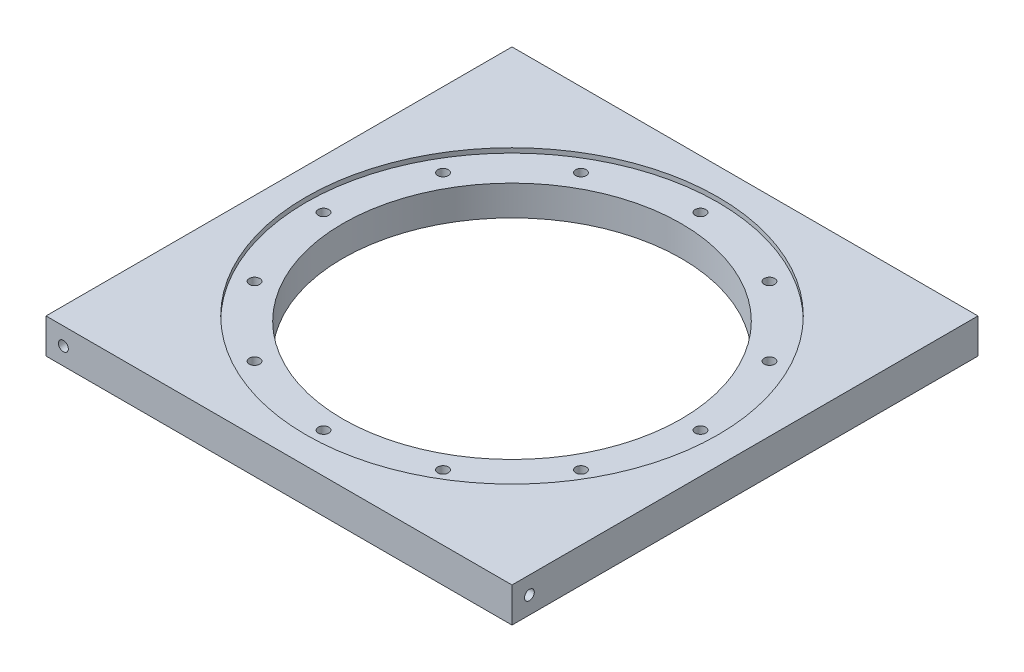
ISO-10303-21;
HEADER;
FILE_DESCRIPTION(('STEP AP214'),'2;1');
FILE_NAME('part.step','',(''),(''),'','','');
FILE_SCHEMA(('AUTOMOTIVE_DESIGN { 1 0 10303 214 1 1 1 1 }'));
ENDSEC;
DATA;
#1=APPLICATION_CONTEXT('core data for automotive mechanical design processes');
#2=APPLICATION_PROTOCOL_DEFINITION('international standard','automotive_design',2000,#1);
#3=PRODUCT_CONTEXT('',#1,'mechanical');
#4=PRODUCT('Part','Part','',(#3));
#5=PRODUCT_RELATED_PRODUCT_CATEGORY('part','',(#4));
#6=PRODUCT_DEFINITION_FORMATION('','',#4);
#7=PRODUCT_DEFINITION_CONTEXT('part definition',#1,'design');
#8=PRODUCT_DEFINITION('design','',#6,#7);
#9=PRODUCT_DEFINITION_SHAPE('','',#8);
#10=(LENGTH_UNIT() NAMED_UNIT(*) SI_UNIT(.MILLI.,.METRE.));
#11=(NAMED_UNIT(*) PLANE_ANGLE_UNIT() SI_UNIT($,.RADIAN.));
#12=(NAMED_UNIT(*) SI_UNIT($,.STERADIAN.) SOLID_ANGLE_UNIT());
#13=UNCERTAINTY_MEASURE_WITH_UNIT(LENGTH_MEASURE(1.E-05),#10,'distance_accuracy_value','');
#14=(GEOMETRIC_REPRESENTATION_CONTEXT(3) GLOBAL_UNCERTAINTY_ASSIGNED_CONTEXT((#13)) GLOBAL_UNIT_ASSIGNED_CONTEXT((#10,
#11,#12)) REPRESENTATION_CONTEXT('',''));
#15=CARTESIAN_POINT('',(0.,0.,0.));
#16=DIRECTION('',(0.,0.,1.));
#17=DIRECTION('',(1.,0.,0.));
#18=AXIS2_PLACEMENT_3D('',#15,#16,#17);
#19=CARTESIAN_POINT('',(63.8175,0.,-63.8175));
#20=DIRECTION('',(0.,1.,0.));
#21=DIRECTION('',(0.,0.,1.));
#22=AXIS2_PLACEMENT_3D('',#19,#20,#21);
#23=CYLINDRICAL_SURFACE('',#22,46.355);
#24=CARTESIAN_POINT('',(63.8175,0.,-63.8175));
#25=DIRECTION('',(0.,1.,0.));
#26=DIRECTION('',(0.,0.,1.));
#27=AXIS2_PLACEMENT_3D('',#24,#25,#26);
#28=CIRCLE('',#27,46.355);
#29=CARTESIAN_POINT('',(63.8175,0.,-17.4625));
#30=VERTEX_POINT('',#29);
#31=EDGE_CURVE('E195',#30,#30,#28,.T.);
#32=ORIENTED_EDGE('',*,*,#31,.F.);
#33=EDGE_LOOP('',(#32));
#34=FACE_BOUND('',#33,.T.);
#35=CARTESIAN_POINT('',(63.8175,8.255,-63.8175));
#36=DIRECTION('',(0.,1.,0.));
#37=DIRECTION('',(0.,0.,1.));
#38=AXIS2_PLACEMENT_3D('',#35,#36,#37);
#39=CIRCLE('',#38,46.355);
#40=CARTESIAN_POINT('',(63.8175,8.255,-17.4625));
#41=VERTEX_POINT('',#40);
#42=EDGE_CURVE('E233',#41,#41,#39,.F.);
#43=ORIENTED_EDGE('',*,*,#42,.F.);
#44=EDGE_LOOP('',(#43));
#45=FACE_BOUND('',#44,.T.);
#46=ADVANCED_FACE('F35',(#34,#45),#23,.F.);
#47=CARTESIAN_POINT('',(63.8175,0.,-115.443));
#48=DIRECTION('',(0.,1.,0.));
#49=DIRECTION('',(0.,0.,1.));
#50=AXIS2_PLACEMENT_3D('',#47,#48,#49);
#51=CYLINDRICAL_SURFACE('',#50,1.4351);
#52=CARTESIAN_POINT('',(63.8175,0.,-115.443));
#53=DIRECTION('',(0.,1.,0.));
#54=DIRECTION('',(0.,0.,1.));
#55=AXIS2_PLACEMENT_3D('',#52,#53,#54);
#56=CIRCLE('',#55,1.4351);
#57=CARTESIAN_POINT('',(63.8175,0.,-114.0079));
#58=VERTEX_POINT('',#57);
#59=EDGE_CURVE('E200',#58,#58,#56,.T.);
#60=ORIENTED_EDGE('',*,*,#59,.F.);
#61=EDGE_LOOP('',(#60));
#62=FACE_BOUND('',#61,.T.);
#63=CARTESIAN_POINT('',(63.8175,8.255,-115.443));
#64=DIRECTION('',(0.,1.,0.));
#65=DIRECTION('',(0.,0.,1.));
#66=AXIS2_PLACEMENT_3D('',#63,#64,#65);
#67=CIRCLE('',#66,1.4351);
#68=CARTESIAN_POINT('',(63.8175,8.255,-114.0079));
#69=VERTEX_POINT('',#68);
#70=EDGE_CURVE('E238',#69,#69,#67,.F.);
#71=ORIENTED_EDGE('',*,*,#70,.F.);
#72=EDGE_LOOP('',(#71));
#73=FACE_BOUND('',#72,.T.);
#74=ADVANCED_FACE('F131',(#62,#73),#51,.F.);
#75=CARTESIAN_POINT('',(38.0047499999999,0.,-108.526494483073));
#76=DIRECTION('',(0.,1.,0.));
#77=DIRECTION('',(0.,0.,1.));
#78=AXIS2_PLACEMENT_3D('',#75,#76,#77);
#79=CYLINDRICAL_SURFACE('',#78,1.4351);
#80=CARTESIAN_POINT('',(38.0047499999999,0.,-108.526494483073));
#81=DIRECTION('',(0.,1.,0.));
#82=DIRECTION('',(0.500000000000001,0.,0.866025403784438));
#83=AXIS2_PLACEMENT_3D('',#80,#81,#82);
#84=CIRCLE('',#83,1.4351);
#85=CARTESIAN_POINT('',(38.7222999999999,0.,-107.283661426102));
#86=VERTEX_POINT('',#85);
#87=EDGE_CURVE('E203',#86,#86,#84,.T.);
#88=ORIENTED_EDGE('',*,*,#87,.F.);
#89=EDGE_LOOP('',(#88));
#90=FACE_BOUND('',#89,.T.);
#91=CARTESIAN_POINT('',(38.0047499999999,8.255,-108.526494483073));
#92=DIRECTION('',(0.,1.,0.));
#93=DIRECTION('',(0.,0.,1.));
#94=AXIS2_PLACEMENT_3D('',#91,#92,#93);
#95=CIRCLE('',#94,1.4351);
#96=CARTESIAN_POINT('',(38.0047499999999,8.255,-107.091394483074));
#97=VERTEX_POINT('',#96);
#98=EDGE_CURVE('E241',#97,#97,#95,.F.);
#99=ORIENTED_EDGE('',*,*,#98,.F.);
#100=EDGE_LOOP('',(#99));
#101=FACE_BOUND('',#100,.T.);
#102=ADVANCED_FACE('F137',(#90,#101),#79,.F.);
#103=CARTESIAN_POINT('',(89.6302499999994,0.,-108.526494483074));
#104=DIRECTION('',(0.,1.,0.));
#105=DIRECTION('',(0.,0.,1.));
#106=AXIS2_PLACEMENT_3D('',#103,#104,#105);
#107=CYLINDRICAL_SURFACE('',#106,1.4351);
#108=CARTESIAN_POINT('',(89.6302499999994,0.,-108.526494483074));
#109=DIRECTION('',(0.,1.,0.));
#110=DIRECTION('',(-0.499999999999989,0.,0.866025403784445));
#111=AXIS2_PLACEMENT_3D('',#108,#109,#110);
#112=CIRCLE('',#111,1.4351);
#113=CARTESIAN_POINT('',(88.9126999999994,0.,-107.283661426103));
#114=VERTEX_POINT('',#113);
#115=EDGE_CURVE('E230',#114,#114,#112,.T.);
#116=ORIENTED_EDGE('',*,*,#115,.F.);
#117=EDGE_LOOP('',(#116));
#118=FACE_BOUND('',#117,.T.);
#119=CARTESIAN_POINT('',(89.6302499999994,8.255,-108.526494483074));
#120=DIRECTION('',(0.,1.,0.));
#121=DIRECTION('',(0.,0.,1.));
#122=AXIS2_PLACEMENT_3D('',#119,#120,#121);
#123=CIRCLE('',#122,1.4351);
#124=CARTESIAN_POINT('',(89.6302499999994,8.255,-107.091394483074));
#125=VERTEX_POINT('',#124);
#126=EDGE_CURVE('E244',#125,#125,#123,.F.);
#127=ORIENTED_EDGE('',*,*,#126,.F.);
#128=EDGE_LOOP('',(#127));
#129=FACE_BOUND('',#128,.T.);
#130=ADVANCED_FACE('F299',(#118,#129),#107,.F.);
#131=CARTESIAN_POINT('',(108.526494483073,0.,-89.6302500000005));
#132=DIRECTION('',(0.,1.,0.));
#133=DIRECTION('',(0.,0.,1.));
#134=AXIS2_PLACEMENT_3D('',#131,#132,#133);
#135=CYLINDRICAL_SURFACE('',#134,1.4351);
#136=CARTESIAN_POINT('',(108.526494483073,0.,-89.6302500000005));
#137=DIRECTION('',(0.,1.,0.));
#138=DIRECTION('',(-0.866025403784433,0.,0.50000000000001));
#139=AXIS2_PLACEMENT_3D('',#136,#137,#138);
#140=CIRCLE('',#139,1.4351);
#141=CARTESIAN_POINT('',(107.283661426102,0.,-88.9127000000005));
#142=VERTEX_POINT('',#141);
#143=EDGE_CURVE('E211',#142,#142,#140,.T.);
#144=ORIENTED_EDGE('',*,*,#143,.F.);
#145=EDGE_LOOP('',(#144));
#146=FACE_BOUND('',#145,.T.);
#147=CARTESIAN_POINT('',(108.526494483073,8.255,-89.6302500000005));
#148=DIRECTION('',(0.,1.,0.));
#149=DIRECTION('',(0.,0.,1.));
#150=AXIS2_PLACEMENT_3D('',#147,#148,#149);
#151=CIRCLE('',#150,1.4351);
#152=CARTESIAN_POINT('',(108.526494483073,8.255,-88.1951500000005));
#153=VERTEX_POINT('',#152);
#154=EDGE_CURVE('E247',#153,#153,#151,.F.);
#155=ORIENTED_EDGE('',*,*,#154,.F.);
#156=EDGE_LOOP('',(#155));
#157=FACE_BOUND('',#156,.T.);
#158=ADVANCED_FACE('F323',(#146,#157),#135,.F.);
#159=CARTESIAN_POINT('',(115.443,0.,-63.8175000000006));
#160=DIRECTION('',(0.,1.,0.));
#161=DIRECTION('',(0.,0.,1.));
#162=AXIS2_PLACEMENT_3D('',#159,#160,#161);
#163=CYLINDRICAL_SURFACE('',#162,1.4351);
#164=CARTESIAN_POINT('',(115.443,0.,-63.8175000000006));
#165=DIRECTION('',(0.,1.,0.));
#166=DIRECTION('',(-1.,0.,0.));
#167=AXIS2_PLACEMENT_3D('',#164,#165,#166);
#168=CIRCLE('',#167,1.4351);
#169=CARTESIAN_POINT('',(114.0079,0.,-63.8175000000005));
#170=VERTEX_POINT('',#169);
#171=EDGE_CURVE('E207',#170,#170,#168,.T.);
#172=ORIENTED_EDGE('',*,*,#171,.F.);
#173=EDGE_LOOP('',(#172));
#174=FACE_BOUND('',#173,.T.);
#175=CARTESIAN_POINT('',(115.443,8.255,-63.8175000000006));
#176=DIRECTION('',(0.,1.,0.));
#177=DIRECTION('',(0.,0.,1.));
#178=AXIS2_PLACEMENT_3D('',#175,#176,#177);
#179=CIRCLE('',#178,1.4351);
#180=CARTESIAN_POINT('',(115.443,8.255,-62.3824000000006));
#181=VERTEX_POINT('',#180);
#182=EDGE_CURVE('E250',#181,#181,#179,.F.);
#183=ORIENTED_EDGE('',*,*,#182,.F.);
#184=EDGE_LOOP('',(#183));
#185=FACE_BOUND('',#184,.T.);
#186=ADVANCED_FACE('F320',(#174,#185),#163,.F.);
#187=CARTESIAN_POINT('',(108.526494483074,0.,-38.0047500000004));
#188=DIRECTION('',(0.,1.,0.));
#189=DIRECTION('',(0.,0.,1.));
#190=AXIS2_PLACEMENT_3D('',#187,#188,#189);
#191=CYLINDRICAL_SURFACE('',#190,1.4351);
#192=CARTESIAN_POINT('',(108.526494483074,0.,-38.0047500000004));
#193=DIRECTION('',(0.,1.,0.));
#194=DIRECTION('',(-0.866025403784443,0.,-0.499999999999992));
#195=AXIS2_PLACEMENT_3D('',#192,#193,#194);
#196=CIRCLE('',#195,1.4351);
#197=CARTESIAN_POINT('',(107.283661426103,0.,-38.7223000000004));
#198=VERTEX_POINT('',#197);
#199=EDGE_CURVE('E210',#198,#198,#196,.T.);
#200=ORIENTED_EDGE('',*,*,#199,.F.);
#201=EDGE_LOOP('',(#200));
#202=FACE_BOUND('',#201,.T.);
#203=CARTESIAN_POINT('',(108.526494483074,8.255,-38.0047500000004));
#204=DIRECTION('',(0.,1.,0.));
#205=DIRECTION('',(0.,0.,1.));
#206=AXIS2_PLACEMENT_3D('',#203,#204,#205);
#207=CIRCLE('',#206,1.4351);
#208=CARTESIAN_POINT('',(108.526494483074,8.255,-36.5696500000004));
#209=VERTEX_POINT('',#208);
#210=EDGE_CURVE('E253',#209,#209,#207,.F.);
#211=ORIENTED_EDGE('',*,*,#210,.F.);
#212=EDGE_LOOP('',(#211));
#213=FACE_BOUND('',#212,.T.);
#214=ADVANCED_FACE('F316',(#202,#213),#191,.F.);
#215=CARTESIAN_POINT('',(89.6302500000004,0.,-19.1085055169267));
#216=DIRECTION('',(0.,1.,0.));
#217=DIRECTION('',(0.,0.,1.));
#218=AXIS2_PLACEMENT_3D('',#215,#216,#217);
#219=CYLINDRICAL_SURFACE('',#218,1.4351);
#220=CARTESIAN_POINT('',(89.6302500000004,0.,-19.1085055169267));
#221=DIRECTION('',(0.,1.,0.));
#222=DIRECTION('',(-0.500000000000007,0.,-0.866025403784435));
#223=AXIS2_PLACEMENT_3D('',#220,#221,#222);
#224=CIRCLE('',#223,1.4351);
#225=CARTESIAN_POINT('',(88.9127000000003,0.,-20.3513385738977));
#226=VERTEX_POINT('',#225);
#227=EDGE_CURVE('E214',#226,#226,#224,.T.);
#228=ORIENTED_EDGE('',*,*,#227,.F.);
#229=EDGE_LOOP('',(#228));
#230=FACE_BOUND('',#229,.T.);
#231=CARTESIAN_POINT('',(89.6302500000004,8.255,-19.1085055169267));
#232=DIRECTION('',(0.,1.,0.));
#233=DIRECTION('',(0.,0.,1.));
#234=AXIS2_PLACEMENT_3D('',#231,#232,#233);
#235=CIRCLE('',#234,1.4351);
#236=CARTESIAN_POINT('',(89.6302500000004,8.255,-17.6734055169267));
#237=VERTEX_POINT('',#236);
#238=EDGE_CURVE('E256',#237,#237,#235,.F.);
#239=ORIENTED_EDGE('',*,*,#238,.F.);
#240=EDGE_LOOP('',(#239));
#241=FACE_BOUND('',#240,.T.);
#242=ADVANCED_FACE('F312',(#230,#241),#219,.F.);
#243=CARTESIAN_POINT('',(63.8175,0.,-12.192));
#244=DIRECTION('',(0.,1.,0.));
#245=DIRECTION('',(0.,0.,1.));
#246=AXIS2_PLACEMENT_3D('',#243,#244,#245);
#247=CYLINDRICAL_SURFACE('',#246,1.4351);
#248=CARTESIAN_POINT('',(63.8175,0.,-12.192));
#249=DIRECTION('',(0.,1.,0.));
#250=DIRECTION('',(0.,0.,-1.));
#251=AXIS2_PLACEMENT_3D('',#248,#249,#250);
#252=CIRCLE('',#251,1.4351);
#253=CARTESIAN_POINT('',(63.8175,0.,-13.6271));
#254=VERTEX_POINT('',#253);
#255=EDGE_CURVE('E217',#254,#254,#252,.T.);
#256=ORIENTED_EDGE('',*,*,#255,.F.);
#257=EDGE_LOOP('',(#256));
#258=FACE_BOUND('',#257,.T.);
#259=CARTESIAN_POINT('',(63.8175,8.255,-12.192));
#260=DIRECTION('',(0.,1.,0.));
#261=DIRECTION('',(0.,0.,1.));
#262=AXIS2_PLACEMENT_3D('',#259,#260,#261);
#263=CIRCLE('',#262,1.4351);
#264=CARTESIAN_POINT('',(63.8175,8.255,-10.7569));
#265=VERTEX_POINT('',#264);
#266=EDGE_CURVE('E259',#265,#265,#263,.F.);
#267=ORIENTED_EDGE('',*,*,#266,.F.);
#268=EDGE_LOOP('',(#267));
#269=FACE_BOUND('',#268,.T.);
#270=ADVANCED_FACE('F308',(#258,#269),#247,.F.);
#271=CARTESIAN_POINT('',(38.0047500000003,0.,-19.1085055169263));
#272=DIRECTION('',(0.,1.,0.));
#273=DIRECTION('',(0.,0.,1.));
#274=AXIS2_PLACEMENT_3D('',#271,#272,#273);
#275=CYLINDRICAL_SURFACE('',#274,1.4351);
#276=CARTESIAN_POINT('',(38.0047500000003,0.,-19.1085055169263));
#277=DIRECTION('',(0.,1.,0.));
#278=DIRECTION('',(0.499999999999995,0.,-0.866025403784442));
#279=AXIS2_PLACEMENT_3D('',#276,#277,#278);
#280=CIRCLE('',#279,1.4351);
#281=CARTESIAN_POINT('',(38.7223000000002,0.,-20.3513385738974));
#282=VERTEX_POINT('',#281);
#283=EDGE_CURVE('E220',#282,#282,#280,.T.);
#284=ORIENTED_EDGE('',*,*,#283,.F.);
#285=EDGE_LOOP('',(#284));
#286=FACE_BOUND('',#285,.T.);
#287=CARTESIAN_POINT('',(38.0047500000003,8.255,-19.1085055169263));
#288=DIRECTION('',(0.,1.,0.));
#289=DIRECTION('',(0.,0.,1.));
#290=AXIS2_PLACEMENT_3D('',#287,#288,#289);
#291=CIRCLE('',#290,1.4351);
#292=CARTESIAN_POINT('',(38.0047500000003,8.255,-17.6734055169263));
#293=VERTEX_POINT('',#292);
#294=EDGE_CURVE('E262',#293,#293,#291,.F.);
#295=ORIENTED_EDGE('',*,*,#294,.F.);
#296=EDGE_LOOP('',(#295));
#297=FACE_BOUND('',#296,.T.);
#298=ADVANCED_FACE('F304',(#286,#297),#275,.F.);
#299=CARTESIAN_POINT('',(19.1085055169266,0.,-38.0047499999998));
#300=DIRECTION('',(0.,1.,0.));
#301=DIRECTION('',(0.,0.,1.));
#302=AXIS2_PLACEMENT_3D('',#299,#300,#301);
#303=CYLINDRICAL_SURFACE('',#302,1.4351);
#304=CARTESIAN_POINT('',(19.1085055169266,0.,-38.0047499999998));
#305=DIRECTION('',(0.,1.,0.));
#306=DIRECTION('',(0.866025403784436,0.,-0.500000000000004));
#307=AXIS2_PLACEMENT_3D('',#304,#305,#306);
#308=CIRCLE('',#307,1.4351);
#309=CARTESIAN_POINT('',(20.3513385738976,0.,-38.7222999999998));
#310=VERTEX_POINT('',#309);
#311=EDGE_CURVE('E223',#310,#310,#308,.T.);
#312=ORIENTED_EDGE('',*,*,#311,.F.);
#313=EDGE_LOOP('',(#312));
#314=FACE_BOUND('',#313,.T.);
#315=CARTESIAN_POINT('',(19.1085055169266,8.255,-38.0047499999998));
#316=DIRECTION('',(0.,1.,0.));
#317=DIRECTION('',(0.,0.,1.));
#318=AXIS2_PLACEMENT_3D('',#315,#316,#317);
#319=CIRCLE('',#318,1.4351);
#320=CARTESIAN_POINT('',(19.1085055169266,8.255,-36.5696499999998));
#321=VERTEX_POINT('',#320);
#322=EDGE_CURVE('E265',#321,#321,#319,.F.);
#323=ORIENTED_EDGE('',*,*,#322,.F.);
#324=EDGE_LOOP('',(#323));
#325=FACE_BOUND('',#324,.T.);
#326=ADVANCED_FACE('F294',(#314,#325),#303,.F.);
#327=CARTESIAN_POINT('',(12.192,0.,-63.8174999999998));
#328=DIRECTION('',(0.,1.,0.));
#329=DIRECTION('',(0.,0.,1.));
#330=AXIS2_PLACEMENT_3D('',#327,#328,#329);
#331=CYLINDRICAL_SURFACE('',#330,1.4351);
#332=CARTESIAN_POINT('',(12.192,0.,-63.8174999999998));
#333=DIRECTION('',(0.,1.,0.));
#334=DIRECTION('',(1.,0.,0.));
#335=AXIS2_PLACEMENT_3D('',#332,#333,#334);
#336=CIRCLE('',#335,1.4351);
#337=CARTESIAN_POINT('',(13.6271,0.,-63.8174999999998));
#338=VERTEX_POINT('',#337);
#339=EDGE_CURVE('E226',#338,#338,#336,.T.);
#340=ORIENTED_EDGE('',*,*,#339,.F.);
#341=EDGE_LOOP('',(#340));
#342=FACE_BOUND('',#341,.T.);
#343=CARTESIAN_POINT('',(12.192,8.255,-63.8174999999998));
#344=DIRECTION('',(0.,1.,0.));
#345=DIRECTION('',(0.,0.,1.));
#346=AXIS2_PLACEMENT_3D('',#343,#344,#345);
#347=CIRCLE('',#346,1.4351);
#348=CARTESIAN_POINT('',(12.192,8.255,-62.3823999999998));
#349=VERTEX_POINT('',#348);
#350=EDGE_CURVE('E268',#349,#349,#347,.F.);
#351=ORIENTED_EDGE('',*,*,#350,.F.);
#352=EDGE_LOOP('',(#351));
#353=FACE_BOUND('',#352,.T.);
#354=ADVANCED_FACE('F285',(#342,#353),#331,.F.);
#355=CARTESIAN_POINT('',(19.1085055169264,0.,-89.6302499999999));
#356=DIRECTION('',(0.,1.,0.));
#357=DIRECTION('',(0.,0.,1.));
#358=AXIS2_PLACEMENT_3D('',#355,#356,#357);
#359=CYLINDRICAL_SURFACE('',#358,1.4351);
#360=CARTESIAN_POINT('',(19.1085055169264,0.,-89.6302499999999));
#361=DIRECTION('',(0.,1.,0.));
#362=DIRECTION('',(0.86602540378444,0.,0.499999999999998));
#363=AXIS2_PLACEMENT_3D('',#360,#361,#362);
#364=CIRCLE('',#363,1.4351);
#365=CARTESIAN_POINT('',(20.3513385738974,0.,-88.9126999999999));
#366=VERTEX_POINT('',#365);
#367=EDGE_CURVE('E206',#366,#366,#364,.T.);
#368=ORIENTED_EDGE('',*,*,#367,.F.);
#369=EDGE_LOOP('',(#368));
#370=FACE_BOUND('',#369,.T.);
#371=CARTESIAN_POINT('',(19.1085055169264,8.255,-89.6302499999999));
#372=DIRECTION('',(0.,1.,0.));
#373=DIRECTION('',(0.,0.,1.));
#374=AXIS2_PLACEMENT_3D('',#371,#372,#373);
#375=CIRCLE('',#374,1.4351);
#376=CARTESIAN_POINT('',(19.1085055169264,8.255,-88.1951499999999));
#377=VERTEX_POINT('',#376);
#378=EDGE_CURVE('E39',#377,#377,#375,.F.);
#379=ORIENTED_EDGE('',*,*,#378,.F.);
#380=EDGE_LOOP('',(#379));
#381=FACE_BOUND('',#380,.T.);
#382=ADVANCED_FACE('F283',(#370,#381),#359,.F.);
#383=CARTESIAN_POINT('',(0.,9.525,0.));
#384=DIRECTION('',(-1.,0.,0.));
#385=DIRECTION('',(0.,0.,1.));
#386=AXIS2_PLACEMENT_3D('',#383,#384,#385);
#387=PLANE('',#386);
#388=CARTESIAN_POINT('',(0.,4.7625,-122.8725));
#389=DIRECTION('',(-1.,0.,0.));
#390=DIRECTION('',(0.,0.,1.));
#391=AXIS2_PLACEMENT_3D('',#388,#389,#390);
#392=CIRCLE('',#391,1.35255);
#393=CARTESIAN_POINT('',(0.,4.7625,-121.51995));
#394=VERTEX_POINT('',#393);
#395=EDGE_CURVE('E186',#394,#394,#392,.T.);
#396=ORIENTED_EDGE('',*,*,#395,.F.);
#397=EDGE_LOOP('',(#396));
#398=FACE_BOUND('',#397,.T.);
#399=DIRECTION('',(0.,0.,-1.));
#400=VECTOR('',#399,1.);
#401=CARTESIAN_POINT('',(0.,0.,0.));
#402=LINE('',#401,#400);
#403=CARTESIAN_POINT('',(0.,0.,0.));
#404=VERTEX_POINT('',#403);
#405=CARTESIAN_POINT('',(0.,0.,-127.635));
#406=VERTEX_POINT('',#405);
#407=EDGE_CURVE('E104',#404,#406,#402,.T.);
#408=ORIENTED_EDGE('',*,*,#407,.F.);
#409=DIRECTION('',(0.,-1.,0.));
#410=VECTOR('',#409,1.);
#411=CARTESIAN_POINT('',(0.,9.525,0.));
#412=LINE('',#411,#410);
#413=CARTESIAN_POINT('',(0.,9.525,0.));
#414=VERTEX_POINT('',#413);
#415=EDGE_CURVE('E11',#414,#404,#412,.T.);
#416=ORIENTED_EDGE('',*,*,#415,.F.);
#417=DIRECTION('',(0.,0.,-1.));
#418=VECTOR('',#417,1.);
#419=CARTESIAN_POINT('',(0.,9.525,0.));
#420=LINE('',#419,#418);
#421=CARTESIAN_POINT('',(0.,9.525,-127.635));
#422=VERTEX_POINT('',#421);
#423=EDGE_CURVE('E98',#414,#422,#420,.T.);
#424=ORIENTED_EDGE('',*,*,#423,.T.);
#425=DIRECTION('',(0.,-1.,0.));
#426=VECTOR('',#425,1.);
#427=CARTESIAN_POINT('',(0.,9.525,-127.635));
#428=LINE('',#427,#426);
#429=EDGE_CURVE('E77',#422,#406,#428,.T.);
#430=ORIENTED_EDGE('',*,*,#429,.T.);
#431=EDGE_LOOP('',(#408,#416,#424,#430));
#432=FACE_BOUND('',#431,.T.);
#433=ADVANCED_FACE('F37',(#398,#432),#387,.T.);
#434=CARTESIAN_POINT('',(0.,9.525,0.));
#435=DIRECTION('',(0.,0.,-1.));
#436=DIRECTION('',(-1.,0.,0.));
#437=AXIS2_PLACEMENT_3D('',#434,#435,#436);
#438=PLANE('',#437);
#439=CARTESIAN_POINT('',(4.76249999999993,4.7625,0.));
#440=DIRECTION('',(0.,0.,1.));
#441=DIRECTION('',(1.,0.,0.));
#442=AXIS2_PLACEMENT_3D('',#439,#440,#441);
#443=CIRCLE('',#442,1.35255);
#444=CARTESIAN_POINT('',(6.11504999999993,4.7625,0.));
#445=VERTEX_POINT('',#444);
#446=EDGE_CURVE('E192',#445,#445,#443,.T.);
#447=ORIENTED_EDGE('',*,*,#446,.F.);
#448=EDGE_LOOP('',(#447));
#449=FACE_BOUND('',#448,.T.);
#450=DIRECTION('',(1.,0.,0.));
#451=VECTOR('',#450,1.);
#452=CARTESIAN_POINT('',(0.,0.,0.));
#453=LINE('',#452,#451);
#454=CARTESIAN_POINT('',(127.635,0.,0.));
#455=VERTEX_POINT('',#454);
#456=EDGE_CURVE('E69',#404,#455,#453,.T.);
#457=ORIENTED_EDGE('',*,*,#456,.T.);
#458=DIRECTION('',(0.,-1.,0.));
#459=VECTOR('',#458,1.);
#460=CARTESIAN_POINT('',(127.635,9.525,0.));
#461=LINE('',#460,#459);
#462=CARTESIAN_POINT('',(127.635,9.525,0.));
#463=VERTEX_POINT('',#462);
#464=EDGE_CURVE('E45',#463,#455,#461,.T.);
#465=ORIENTED_EDGE('',*,*,#464,.F.);
#466=DIRECTION('',(1.,0.,0.));
#467=VECTOR('',#466,1.);
#468=CARTESIAN_POINT('',(0.,9.525,0.));
#469=LINE('',#468,#467);
#470=EDGE_CURVE('E87',#414,#463,#469,.T.);
#471=ORIENTED_EDGE('',*,*,#470,.F.);
#472=ORIENTED_EDGE('',*,*,#415,.T.);
#473=EDGE_LOOP('',(#457,#465,#471,#472));
#474=FACE_BOUND('',#473,.T.);
#475=ADVANCED_FACE('F292',(#449,#474),#438,.F.);
#476=CARTESIAN_POINT('',(127.635,9.525,0.));
#477=DIRECTION('',(-1.,0.,0.));
#478=DIRECTION('',(0.,0.,1.));
#479=AXIS2_PLACEMENT_3D('',#476,#477,#478);
#480=PLANE('',#479);
#481=CARTESIAN_POINT('',(127.635,4.7625,-4.76250000000004));
#482=DIRECTION('',(1.,0.,0.));
#483=DIRECTION('',(0.,0.,-1.));
#484=AXIS2_PLACEMENT_3D('',#481,#482,#483);
#485=CIRCLE('',#484,1.35255);
#486=CARTESIAN_POINT('',(127.635,4.7625,-6.11505000000004));
#487=VERTEX_POINT('',#486);
#488=EDGE_CURVE('E175',#487,#487,#485,.T.);
#489=ORIENTED_EDGE('',*,*,#488,.F.);
#490=EDGE_LOOP('',(#489));
#491=FACE_BOUND('',#490,.T.);
#492=DIRECTION('',(0.,0.,-1.));
#493=VECTOR('',#492,1.);
#494=CARTESIAN_POINT('',(127.635,0.,0.));
#495=LINE('',#494,#493);
#496=CARTESIAN_POINT('',(127.635,0.,-127.635));
#497=VERTEX_POINT('',#496);
#498=EDGE_CURVE('E94',#455,#497,#495,.T.);
#499=ORIENTED_EDGE('',*,*,#498,.T.);
#500=DIRECTION('',(0.,-1.,0.));
#501=VECTOR('',#500,1.);
#502=CARTESIAN_POINT('',(127.635,9.525,-127.635));
#503=LINE('',#502,#501);
#504=CARTESIAN_POINT('',(127.635,9.525,-127.635));
#505=VERTEX_POINT('',#504);
#506=EDGE_CURVE('E91',#505,#497,#503,.T.);
#507=ORIENTED_EDGE('',*,*,#506,.F.);
#508=DIRECTION('',(0.,0.,-1.));
#509=VECTOR('',#508,1.);
#510=CARTESIAN_POINT('',(127.635,9.525,0.));
#511=LINE('',#510,#509);
#512=EDGE_CURVE('E82',#463,#505,#511,.T.);
#513=ORIENTED_EDGE('',*,*,#512,.F.);
#514=ORIENTED_EDGE('',*,*,#464,.T.);
#515=EDGE_LOOP('',(#499,#507,#513,#514));
#516=FACE_BOUND('',#515,.T.);
#517=ADVANCED_FACE('F92',(#491,#516),#480,.F.);
#518=CARTESIAN_POINT('',(0.,9.525,-127.635));
#519=DIRECTION('',(0.,0.,-1.));
#520=DIRECTION('',(-1.,0.,0.));
#521=AXIS2_PLACEMENT_3D('',#518,#519,#520);
#522=PLANE('',#521);
#523=CARTESIAN_POINT('',(122.8725,4.7625,-127.635));
#524=DIRECTION('',(0.,0.,-1.));
#525=DIRECTION('',(-1.,0.,0.));
#526=AXIS2_PLACEMENT_3D('',#523,#524,#525);
#527=CIRCLE('',#526,1.35255);
#528=CARTESIAN_POINT('',(121.51995,4.7625,-127.635));
#529=VERTEX_POINT('',#528);
#530=EDGE_CURVE('E180',#529,#529,#527,.T.);
#531=ORIENTED_EDGE('',*,*,#530,.F.);
#532=EDGE_LOOP('',(#531));
#533=FACE_BOUND('',#532,.T.);
#534=DIRECTION('',(1.,0.,0.));
#535=VECTOR('',#534,1.);
#536=CARTESIAN_POINT('',(0.,0.,-127.635));
#537=LINE('',#536,#535);
#538=EDGE_CURVE('E107',#406,#497,#537,.T.);
#539=ORIENTED_EDGE('',*,*,#538,.F.);
#540=ORIENTED_EDGE('',*,*,#429,.F.);
#541=DIRECTION('',(1.,0.,0.));
#542=VECTOR('',#541,1.);
#543=CARTESIAN_POINT('',(0.,9.525,-127.635));
#544=LINE('',#543,#542);
#545=EDGE_CURVE('E86',#422,#505,#544,.T.);
#546=ORIENTED_EDGE('',*,*,#545,.T.);
#547=ORIENTED_EDGE('',*,*,#506,.T.);
#548=EDGE_LOOP('',(#539,#540,#546,#547));
#549=FACE_BOUND('',#548,.T.);
#550=ADVANCED_FACE('F97',(#533,#549),#522,.T.);
#551=CARTESIAN_POINT('',(0.,9.525,0.));
#552=DIRECTION('',(0.,-1.,0.));
#553=DIRECTION('',(0.,0.,-1.));
#554=AXIS2_PLACEMENT_3D('',#551,#552,#553);
#555=PLANE('',#554);
#556=CARTESIAN_POINT('',(63.8175,9.525,-63.8175));
#557=DIRECTION('',(0.,1.,0.));
#558=DIRECTION('',(0.,0.,1.));
#559=AXIS2_PLACEMENT_3D('',#556,#557,#558);
#560=CIRCLE('',#559,56.41975);
#561=CARTESIAN_POINT('',(63.8175,9.525,-7.39774999999999));
#562=VERTEX_POINT('',#561);
#563=EDGE_CURVE('E271',#562,#562,#560,.T.);
#564=ORIENTED_EDGE('',*,*,#563,.F.);
#565=EDGE_LOOP('',(#564));
#566=FACE_BOUND('',#565,.T.);
#567=ORIENTED_EDGE('',*,*,#423,.F.);
#568=ORIENTED_EDGE('',*,*,#470,.T.);
#569=ORIENTED_EDGE('',*,*,#512,.T.);
#570=ORIENTED_EDGE('',*,*,#545,.F.);
#571=EDGE_LOOP('',(#567,#568,#569,#570));
#572=FACE_BOUND('',#571,.T.);
#573=ADVANCED_FACE('F85',(#566,#572),#555,.F.);
#574=CARTESIAN_POINT('',(0.,0.,0.));
#575=DIRECTION('',(0.,-1.,0.));
#576=DIRECTION('',(0.,0.,-1.));
#577=AXIS2_PLACEMENT_3D('',#574,#575,#576);
#578=PLANE('',#577);
#579=ORIENTED_EDGE('',*,*,#367,.T.);
#580=EDGE_LOOP('',(#579));
#581=FACE_BOUND('',#580,.T.);
#582=ORIENTED_EDGE('',*,*,#339,.T.);
#583=EDGE_LOOP('',(#582));
#584=FACE_BOUND('',#583,.T.);
#585=ORIENTED_EDGE('',*,*,#311,.T.);
#586=EDGE_LOOP('',(#585));
#587=FACE_BOUND('',#586,.T.);
#588=ORIENTED_EDGE('',*,*,#283,.T.);
#589=EDGE_LOOP('',(#588));
#590=FACE_BOUND('',#589,.T.);
#591=ORIENTED_EDGE('',*,*,#255,.T.);
#592=EDGE_LOOP('',(#591));
#593=FACE_BOUND('',#592,.T.);
#594=ORIENTED_EDGE('',*,*,#227,.T.);
#595=EDGE_LOOP('',(#594));
#596=FACE_BOUND('',#595,.T.);
#597=ORIENTED_EDGE('',*,*,#199,.T.);
#598=EDGE_LOOP('',(#597));
#599=FACE_BOUND('',#598,.T.);
#600=ORIENTED_EDGE('',*,*,#171,.T.);
#601=EDGE_LOOP('',(#600));
#602=FACE_BOUND('',#601,.T.);
#603=ORIENTED_EDGE('',*,*,#143,.T.);
#604=EDGE_LOOP('',(#603));
#605=FACE_BOUND('',#604,.T.);
#606=ORIENTED_EDGE('',*,*,#115,.T.);
#607=EDGE_LOOP('',(#606));
#608=FACE_BOUND('',#607,.T.);
#609=ORIENTED_EDGE('',*,*,#87,.T.);
#610=EDGE_LOOP('',(#609));
#611=FACE_BOUND('',#610,.T.);
#612=ORIENTED_EDGE('',*,*,#59,.T.);
#613=EDGE_LOOP('',(#612));
#614=FACE_BOUND('',#613,.T.);
#615=ORIENTED_EDGE('',*,*,#31,.T.);
#616=EDGE_LOOP('',(#615));
#617=FACE_BOUND('',#616,.T.);
#618=ORIENTED_EDGE('',*,*,#407,.T.);
#619=ORIENTED_EDGE('',*,*,#538,.T.);
#620=ORIENTED_EDGE('',*,*,#498,.F.);
#621=ORIENTED_EDGE('',*,*,#456,.F.);
#622=EDGE_LOOP('',(#618,#619,#620,#621));
#623=FACE_BOUND('',#622,.T.);
#624=ADVANCED_FACE('F113',(#581,#584,#587,#590,#593,#596,#599,#602,#605,#608,#611,#614,#617,
#623),#578,.T.);
#625=CARTESIAN_POINT('',(114.935,4.7625,-4.76250000000004));
#626=DIRECTION('',(1.,0.,0.));
#627=DIRECTION('',(0.,0.,-1.));
#628=AXIS2_PLACEMENT_3D('',#625,#626,#627);
#629=CYLINDRICAL_SURFACE('',#628,1.35255);
#630=CARTESIAN_POINT('',(114.935,4.7625,-4.76250000000004));
#631=DIRECTION('',(1.,0.,0.));
#632=DIRECTION('',(0.,0.,-1.));
#633=AXIS2_PLACEMENT_3D('',#630,#631,#632);
#634=CIRCLE('',#633,1.35255);
#635=CARTESIAN_POINT('',(114.935,4.7625,-6.11505000000004));
#636=VERTEX_POINT('',#635);
#637=EDGE_CURVE('E108',#636,#636,#634,.T.);
#638=ORIENTED_EDGE('',*,*,#637,.F.);
#639=EDGE_LOOP('',(#638));
#640=FACE_BOUND('',#639,.T.);
#641=ORIENTED_EDGE('',*,*,#488,.T.);
#642=EDGE_LOOP('',(#641));
#643=FACE_BOUND('',#642,.T.);
#644=ADVANCED_FACE('F115',(#640,#643),#629,.F.);
#645=CARTESIAN_POINT('',(114.935,4.7625,-4.76250000000004));
#646=DIRECTION('',(1.,0.,0.));
#647=DIRECTION('',(0.,0.,-1.));
#648=AXIS2_PLACEMENT_3D('',#645,#646,#647);
#649=PLANE('',#648);
#650=ORIENTED_EDGE('',*,*,#637,.T.);
#651=EDGE_LOOP('',(#650));
#652=FACE_BOUND('',#651,.T.);
#653=ADVANCED_FACE('F122',(#652),#649,.T.);
#654=CARTESIAN_POINT('',(122.8725,4.7625,-114.935));
#655=DIRECTION('',(0.,0.,-1.));
#656=DIRECTION('',(-1.,0.,0.));
#657=AXIS2_PLACEMENT_3D('',#654,#655,#656);
#658=CYLINDRICAL_SURFACE('',#657,1.35255);
#659=CARTESIAN_POINT('',(122.8725,4.7625,-114.935));
#660=DIRECTION('',(0.,0.,-1.));
#661=DIRECTION('',(-1.,0.,0.));
#662=AXIS2_PLACEMENT_3D('',#659,#660,#661);
#663=CIRCLE('',#662,1.35255);
#664=CARTESIAN_POINT('',(121.51995,4.7625,-114.935));
#665=VERTEX_POINT('',#664);
#666=EDGE_CURVE('E178',#665,#665,#663,.T.);
#667=ORIENTED_EDGE('',*,*,#666,.F.);
#668=EDGE_LOOP('',(#667));
#669=FACE_BOUND('',#668,.T.);
#670=ORIENTED_EDGE('',*,*,#530,.T.);
#671=EDGE_LOOP('',(#670));
#672=FACE_BOUND('',#671,.T.);
#673=ADVANCED_FACE('F164',(#669,#672),#658,.F.);
#674=CARTESIAN_POINT('',(122.8725,4.7625,-114.935));
#675=DIRECTION('',(0.,0.,-1.));
#676=DIRECTION('',(-1.,0.,0.));
#677=AXIS2_PLACEMENT_3D('',#674,#675,#676);
#678=PLANE('',#677);
#679=ORIENTED_EDGE('',*,*,#666,.T.);
#680=EDGE_LOOP('',(#679));
#681=FACE_BOUND('',#680,.T.);
#682=ADVANCED_FACE('F160',(#681),#678,.T.);
#683=CARTESIAN_POINT('',(12.7,4.7625,-122.8725));
#684=DIRECTION('',(-1.,0.,0.));
#685=DIRECTION('',(0.,0.,1.));
#686=AXIS2_PLACEMENT_3D('',#683,#684,#685);
#687=CYLINDRICAL_SURFACE('',#686,1.35255);
#688=CARTESIAN_POINT('',(12.7,4.7625,-122.8725));
#689=DIRECTION('',(-1.,0.,0.));
#690=DIRECTION('',(0.,0.,1.));
#691=AXIS2_PLACEMENT_3D('',#688,#689,#690);
#692=CIRCLE('',#691,1.35255);
#693=CARTESIAN_POINT('',(12.7,4.7625,-121.51995));
#694=VERTEX_POINT('',#693);
#695=EDGE_CURVE('E183',#694,#694,#692,.T.);
#696=ORIENTED_EDGE('',*,*,#695,.F.);
#697=EDGE_LOOP('',(#696));
#698=FACE_BOUND('',#697,.T.);
#699=ORIENTED_EDGE('',*,*,#395,.T.);
#700=EDGE_LOOP('',(#699));
#701=FACE_BOUND('',#700,.T.);
#702=ADVANCED_FACE('F156',(#698,#701),#687,.F.);
#703=CARTESIAN_POINT('',(12.7,4.7625,-122.8725));
#704=DIRECTION('',(-1.,0.,0.));
#705=DIRECTION('',(0.,0.,1.));
#706=AXIS2_PLACEMENT_3D('',#703,#704,#705);
#707=PLANE('',#706);
#708=ORIENTED_EDGE('',*,*,#695,.T.);
#709=EDGE_LOOP('',(#708));
#710=FACE_BOUND('',#709,.T.);
#711=ADVANCED_FACE('F152',(#710),#707,.T.);
#712=CARTESIAN_POINT('',(4.76249999999993,4.7625,-12.7));
#713=DIRECTION('',(0.,0.,1.));
#714=DIRECTION('',(1.,0.,0.));
#715=AXIS2_PLACEMENT_3D('',#712,#713,#714);
#716=CYLINDRICAL_SURFACE('',#715,1.35255);
#717=CARTESIAN_POINT('',(4.76249999999993,4.7625,-12.7));
#718=DIRECTION('',(0.,0.,1.));
#719=DIRECTION('',(1.,0.,0.));
#720=AXIS2_PLACEMENT_3D('',#717,#718,#719);
#721=CIRCLE('',#720,1.35255);
#722=CARTESIAN_POINT('',(6.11504999999993,4.7625,-12.7));
#723=VERTEX_POINT('',#722);
#724=EDGE_CURVE('E189',#723,#723,#721,.T.);
#725=ORIENTED_EDGE('',*,*,#724,.F.);
#726=EDGE_LOOP('',(#725));
#727=FACE_BOUND('',#726,.T.);
#728=ORIENTED_EDGE('',*,*,#446,.T.);
#729=EDGE_LOOP('',(#728));
#730=FACE_BOUND('',#729,.T.);
#731=ADVANCED_FACE('F148',(#727,#730),#716,.F.);
#732=CARTESIAN_POINT('',(4.76249999999993,4.7625,-12.7));
#733=DIRECTION('',(0.,0.,1.));
#734=DIRECTION('',(1.,0.,0.));
#735=AXIS2_PLACEMENT_3D('',#732,#733,#734);
#736=PLANE('',#735);
#737=ORIENTED_EDGE('',*,*,#724,.T.);
#738=EDGE_LOOP('',(#737));
#739=FACE_BOUND('',#738,.T.);
#740=ADVANCED_FACE('F144',(#739),#736,.T.);
#741=CARTESIAN_POINT('',(63.8175,8.255,-63.8175));
#742=DIRECTION('',(0.,1.,0.));
#743=DIRECTION('',(0.,0.,1.));
#744=AXIS2_PLACEMENT_3D('',#741,#742,#743);
#745=PLANE('',#744);
#746=CARTESIAN_POINT('',(63.8175,8.255,-63.8175));
#747=DIRECTION('',(0.,1.,0.));
#748=DIRECTION('',(0.,0.,1.));
#749=AXIS2_PLACEMENT_3D('',#746,#747,#748);
#750=CIRCLE('',#749,56.41975);
#751=CARTESIAN_POINT('',(63.8175,8.255,-7.39774999999999));
#752=VERTEX_POINT('',#751);
#753=EDGE_CURVE('E274',#752,#752,#750,.T.);
#754=ORIENTED_EDGE('',*,*,#753,.T.);
#755=EDGE_LOOP('',(#754));
#756=FACE_BOUND('',#755,.T.);
#757=ORIENTED_EDGE('',*,*,#378,.T.);
#758=EDGE_LOOP('',(#757));
#759=FACE_BOUND('',#758,.T.);
#760=ORIENTED_EDGE('',*,*,#350,.T.);
#761=EDGE_LOOP('',(#760));
#762=FACE_BOUND('',#761,.T.);
#763=ORIENTED_EDGE('',*,*,#322,.T.);
#764=EDGE_LOOP('',(#763));
#765=FACE_BOUND('',#764,.T.);
#766=ORIENTED_EDGE('',*,*,#294,.T.);
#767=EDGE_LOOP('',(#766));
#768=FACE_BOUND('',#767,.T.);
#769=ORIENTED_EDGE('',*,*,#266,.T.);
#770=EDGE_LOOP('',(#769));
#771=FACE_BOUND('',#770,.T.);
#772=ORIENTED_EDGE('',*,*,#238,.T.);
#773=EDGE_LOOP('',(#772));
#774=FACE_BOUND('',#773,.T.);
#775=ORIENTED_EDGE('',*,*,#210,.T.);
#776=EDGE_LOOP('',(#775));
#777=FACE_BOUND('',#776,.T.);
#778=ORIENTED_EDGE('',*,*,#182,.T.);
#779=EDGE_LOOP('',(#778));
#780=FACE_BOUND('',#779,.T.);
#781=ORIENTED_EDGE('',*,*,#154,.T.);
#782=EDGE_LOOP('',(#781));
#783=FACE_BOUND('',#782,.T.);
#784=ORIENTED_EDGE('',*,*,#126,.T.);
#785=EDGE_LOOP('',(#784));
#786=FACE_BOUND('',#785,.T.);
#787=ORIENTED_EDGE('',*,*,#98,.T.);
#788=EDGE_LOOP('',(#787));
#789=FACE_BOUND('',#788,.T.);
#790=ORIENTED_EDGE('',*,*,#70,.T.);
#791=EDGE_LOOP('',(#790));
#792=FACE_BOUND('',#791,.T.);
#793=ORIENTED_EDGE('',*,*,#42,.T.);
#794=EDGE_LOOP('',(#793));
#795=FACE_BOUND('',#794,.T.);
#796=ADVANCED_FACE('F147',(#756,#759,#762,#765,#768,#771,#774,#777,#780,#783,#786,#789,#792,
#795),#745,.T.);
#797=CARTESIAN_POINT('',(63.8175,8.255,-63.8175));
#798=DIRECTION('',(0.,1.,0.));
#799=DIRECTION('',(0.,0.,1.));
#800=AXIS2_PLACEMENT_3D('',#797,#798,#799);
#801=CYLINDRICAL_SURFACE('',#800,56.41975);
#802=ORIENTED_EDGE('',*,*,#753,.F.);
#803=EDGE_LOOP('',(#802));
#804=FACE_BOUND('',#803,.T.);
#805=ORIENTED_EDGE('',*,*,#563,.T.);
#806=EDGE_LOOP('',(#805));
#807=FACE_BOUND('',#806,.T.);
#808=ADVANCED_FACE('F337',(#804,#807),#801,.F.);
#809=CLOSED_SHELL('',(#46,#74,#102,#130,#158,#186,#214,#242,#270,#298,#326,#354,#382,#433,#475,
#517,#550,#573,#624,#644,#653,#673,#682,#702,#711,#731,#740,#796,#808));
#810=MANIFOLD_SOLID_BREP('B2',#809);
#811=ADVANCED_BREP_SHAPE_REPRESENTATION('',(#18,#810),#14);
#812=SHAPE_DEFINITION_REPRESENTATION(#9,#811);
ENDSEC;
END-ISO-10303-21;
